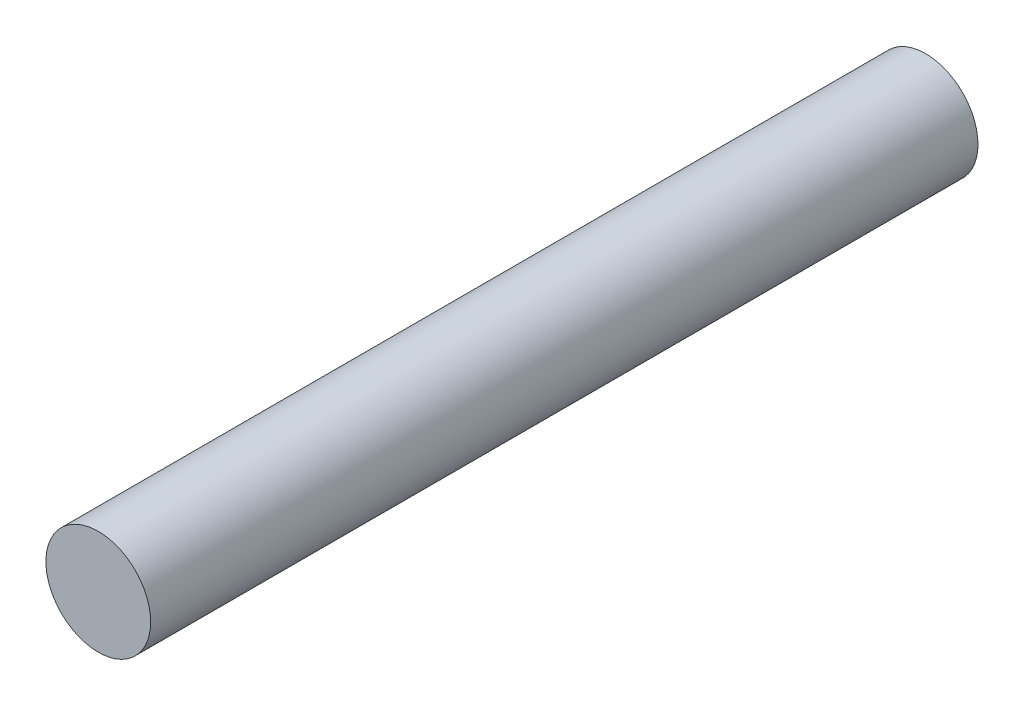
ISO-10303-21;
HEADER;
FILE_DESCRIPTION(('STEP AP214'),'2;1');
FILE_NAME('part.step','',(''),(''),'','','');
FILE_SCHEMA(('AUTOMOTIVE_DESIGN { 1 0 10303 214 1 1 1 1 }'));
ENDSEC;
DATA;
#1=APPLICATION_CONTEXT('core data for automotive mechanical design processes');
#2=APPLICATION_PROTOCOL_DEFINITION('international standard','automotive_design',2000,#1);
#3=PRODUCT_CONTEXT('',#1,'mechanical');
#4=PRODUCT('Part','Part','',(#3));
#5=PRODUCT_RELATED_PRODUCT_CATEGORY('part','',(#4));
#6=PRODUCT_DEFINITION_FORMATION('','',#4);
#7=PRODUCT_DEFINITION_CONTEXT('part definition',#1,'design');
#8=PRODUCT_DEFINITION('design','',#6,#7);
#9=PRODUCT_DEFINITION_SHAPE('','',#8);
#10=(LENGTH_UNIT() NAMED_UNIT(*) SI_UNIT(.MILLI.,.METRE.));
#11=(NAMED_UNIT(*) PLANE_ANGLE_UNIT() SI_UNIT($,.RADIAN.));
#12=(NAMED_UNIT(*) SI_UNIT($,.STERADIAN.) SOLID_ANGLE_UNIT());
#13=UNCERTAINTY_MEASURE_WITH_UNIT(LENGTH_MEASURE(1.E-05),#10,'distance_accuracy_value','');
#14=(GEOMETRIC_REPRESENTATION_CONTEXT(3) GLOBAL_UNCERTAINTY_ASSIGNED_CONTEXT((#13)) GLOBAL_UNIT_ASSIGNED_CONTEXT((#10,
#11,#12)) REPRESENTATION_CONTEXT('',''));
#15=CARTESIAN_POINT('',(0.,0.,0.));
#16=DIRECTION('',(0.,0.,1.));
#17=DIRECTION('',(1.,0.,0.));
#18=AXIS2_PLACEMENT_3D('',#15,#16,#17);
#19=CARTESIAN_POINT('',(0.,0.,7.9));
#20=DIRECTION('',(0.,0.,-1.));
#21=DIRECTION('',(-1.,0.,0.));
#22=AXIS2_PLACEMENT_3D('',#19,#20,#21);
#23=CYLINDRICAL_SURFACE('',#22,1.);
#24=CARTESIAN_POINT('',(0.,0.,7.9));
#25=DIRECTION('',(0.,0.,1.));
#26=DIRECTION('',(1.,0.,0.));
#27=AXIS2_PLACEMENT_3D('',#24,#25,#26);
#28=CIRCLE('',#27,1.);
#29=CARTESIAN_POINT('',(1.,0.,7.9));
#30=VERTEX_POINT('',#29);
#31=EDGE_CURVE('E10',#30,#30,#28,.T.);
#32=ORIENTED_EDGE('',*,*,#31,.F.);
#33=EDGE_LOOP('',(#32));
#34=FACE_BOUND('',#33,.T.);
#35=CARTESIAN_POINT('',(0.,0.,-7.9));
#36=DIRECTION('',(0.,0.,1.));
#37=DIRECTION('',(1.,0.,0.));
#38=AXIS2_PLACEMENT_3D('',#35,#36,#37);
#39=CIRCLE('',#38,1.);
#40=CARTESIAN_POINT('',(1.,0.,-7.9));
#41=VERTEX_POINT('',#40);
#42=EDGE_CURVE('E37',#41,#41,#39,.T.);
#43=ORIENTED_EDGE('',*,*,#42,.T.);
#44=EDGE_LOOP('',(#43));
#45=FACE_BOUND('',#44,.T.);
#46=ADVANCED_FACE('F34',(#34,#45),#23,.T.);
#47=CARTESIAN_POINT('',(0.,0.,7.9));
#48=DIRECTION('',(0.,0.,1.));
#49=DIRECTION('',(1.,0.,0.));
#50=AXIS2_PLACEMENT_3D('',#47,#48,#49);
#51=PLANE('',#50);
#52=ORIENTED_EDGE('',*,*,#31,.T.);
#53=EDGE_LOOP('',(#52));
#54=FACE_BOUND('',#53,.T.);
#55=ADVANCED_FACE('F49',(#54),#51,.T.);
#56=CARTESIAN_POINT('',(0.,0.,-7.9));
#57=DIRECTION('',(0.,0.,1.));
#58=DIRECTION('',(1.,0.,0.));
#59=AXIS2_PLACEMENT_3D('',#56,#57,#58);
#60=PLANE('',#59);
#61=ORIENTED_EDGE('',*,*,#42,.F.);
#62=EDGE_LOOP('',(#61));
#63=FACE_BOUND('',#62,.T.);
#64=ADVANCED_FACE('F47',(#63),#60,.F.);
#65=CLOSED_SHELL('',(#46,#55,#64));
#66=MANIFOLD_SOLID_BREP('B2',#65);
#67=ADVANCED_BREP_SHAPE_REPRESENTATION('',(#18,#66),#14);
#68=SHAPE_DEFINITION_REPRESENTATION(#9,#67);
ENDSEC;
END-ISO-10303-21;
